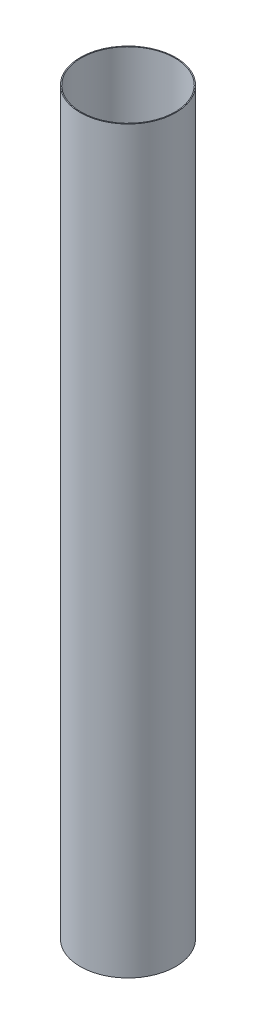
ISO-10303-21;
HEADER;
FILE_DESCRIPTION(('STEP AP214'),'2;1');
FILE_NAME('part.step','',(''),(''),'','','');
FILE_SCHEMA(('AUTOMOTIVE_DESIGN { 1 0 10303 214 1 1 1 1 }'));
ENDSEC;
DATA;
#1=APPLICATION_CONTEXT('core data for automotive mechanical design processes');
#2=APPLICATION_PROTOCOL_DEFINITION('international standard','automotive_design',2000,#1);
#3=PRODUCT_CONTEXT('',#1,'mechanical');
#4=PRODUCT('Part','Part','',(#3));
#5=PRODUCT_RELATED_PRODUCT_CATEGORY('part','',(#4));
#6=PRODUCT_DEFINITION_FORMATION('','',#4);
#7=PRODUCT_DEFINITION_CONTEXT('part definition',#1,'design');
#8=PRODUCT_DEFINITION('design','',#6,#7);
#9=PRODUCT_DEFINITION_SHAPE('','',#8);
#10=(LENGTH_UNIT() NAMED_UNIT(*) SI_UNIT(.MILLI.,.METRE.));
#11=(NAMED_UNIT(*) PLANE_ANGLE_UNIT() SI_UNIT($,.RADIAN.));
#12=(NAMED_UNIT(*) SI_UNIT($,.STERADIAN.) SOLID_ANGLE_UNIT());
#13=UNCERTAINTY_MEASURE_WITH_UNIT(LENGTH_MEASURE(1.E-05),#10,'distance_accuracy_value','');
#14=(GEOMETRIC_REPRESENTATION_CONTEXT(3) GLOBAL_UNCERTAINTY_ASSIGNED_CONTEXT((#13)) GLOBAL_UNIT_ASSIGNED_CONTEXT((#10,
#11,#12)) REPRESENTATION_CONTEXT('',''));
#15=CARTESIAN_POINT('',(0.,0.,0.));
#16=DIRECTION('',(0.,0.,1.));
#17=DIRECTION('',(1.,0.,0.));
#18=AXIS2_PLACEMENT_3D('',#15,#16,#17);
#19=CARTESIAN_POINT('',(0.,1041.4,0.));
#20=DIRECTION('',(0.,1.,0.));
#21=DIRECTION('',(0.,0.,1.));
#22=AXIS2_PLACEMENT_3D('',#19,#20,#21);
#23=PLANE('',#22);
#24=CARTESIAN_POINT('',(0.,1041.4,0.));
#25=DIRECTION('',(0.,1.,0.));
#26=DIRECTION('',(0.,0.,1.));
#27=AXIS2_PLACEMENT_3D('',#24,#25,#26);
#28=CIRCLE('',#27,67.31);
#29=CARTESIAN_POINT('',(0.,1041.4,67.31));
#30=VERTEX_POINT('',#29);
#31=EDGE_CURVE('E10',#30,#30,#28,.T.);
#32=ORIENTED_EDGE('',*,*,#31,.T.);
#33=EDGE_LOOP('',(#32));
#34=FACE_BOUND('',#33,.T.);
#35=CARTESIAN_POINT('',(0.,1041.4,0.));
#36=DIRECTION('',(0.,1.,0.));
#37=DIRECTION('',(0.,0.,1.));
#38=AXIS2_PLACEMENT_3D('',#35,#36,#37);
#39=CIRCLE('',#38,66.04);
#40=CARTESIAN_POINT('',(0.,1041.4,66.04));
#41=VERTEX_POINT('',#40);
#42=EDGE_CURVE('E41',#41,#41,#39,.T.);
#43=ORIENTED_EDGE('',*,*,#42,.F.);
#44=EDGE_LOOP('',(#43));
#45=FACE_BOUND('',#44,.T.);
#46=ADVANCED_FACE('F30',(#34,#45),#23,.T.);
#47=CARTESIAN_POINT('',(0.,0.,0.));
#48=DIRECTION('',(0.,1.,0.));
#49=DIRECTION('',(0.,0.,1.));
#50=AXIS2_PLACEMENT_3D('',#47,#48,#49);
#51=PLANE('',#50);
#52=CARTESIAN_POINT('',(0.,0.,0.));
#53=DIRECTION('',(0.,1.,0.));
#54=DIRECTION('',(0.,0.,1.));
#55=AXIS2_PLACEMENT_3D('',#52,#53,#54);
#56=CIRCLE('',#55,67.31);
#57=CARTESIAN_POINT('',(0.,0.,67.31));
#58=VERTEX_POINT('',#57);
#59=EDGE_CURVE('E34',#58,#58,#56,.T.);
#60=ORIENTED_EDGE('',*,*,#59,.F.);
#61=EDGE_LOOP('',(#60));
#62=FACE_BOUND('',#61,.T.);
#63=CARTESIAN_POINT('',(0.,0.,0.));
#64=DIRECTION('',(0.,1.,0.));
#65=DIRECTION('',(0.,0.,1.));
#66=AXIS2_PLACEMENT_3D('',#63,#64,#65);
#67=CIRCLE('',#66,66.04);
#68=CARTESIAN_POINT('',(0.,0.,66.04));
#69=VERTEX_POINT('',#68);
#70=EDGE_CURVE('E43',#69,#69,#67,.T.);
#71=ORIENTED_EDGE('',*,*,#70,.T.);
#72=EDGE_LOOP('',(#71));
#73=FACE_BOUND('',#72,.T.);
#74=ADVANCED_FACE('F53',(#62,#73),#51,.F.);
#75=CARTESIAN_POINT('',(0.,1041.4,0.));
#76=DIRECTION('',(0.,-1.,0.));
#77=DIRECTION('',(0.,0.,-1.));
#78=AXIS2_PLACEMENT_3D('',#75,#76,#77);
#79=CYLINDRICAL_SURFACE('',#78,67.31);
#80=ORIENTED_EDGE('',*,*,#31,.F.);
#81=EDGE_LOOP('',(#80));
#82=FACE_BOUND('',#81,.T.);
#83=ORIENTED_EDGE('',*,*,#59,.T.);
#84=EDGE_LOOP('',(#83));
#85=FACE_BOUND('',#84,.T.);
#86=ADVANCED_FACE('F32',(#82,#85),#79,.T.);
#87=CARTESIAN_POINT('',(0.,1041.4,0.));
#88=DIRECTION('',(0.,-1.,0.));
#89=DIRECTION('',(0.,0.,-1.));
#90=AXIS2_PLACEMENT_3D('',#87,#88,#89);
#91=CYLINDRICAL_SURFACE('',#90,66.04);
#92=ORIENTED_EDGE('',*,*,#42,.T.);
#93=EDGE_LOOP('',(#92));
#94=FACE_BOUND('',#93,.T.);
#95=ORIENTED_EDGE('',*,*,#70,.F.);
#96=EDGE_LOOP('',(#95));
#97=FACE_BOUND('',#96,.T.);
#98=ADVANCED_FACE('F49',(#94,#97),#91,.F.);
#99=CLOSED_SHELL('',(#46,#74,#86,#98));
#100=MANIFOLD_SOLID_BREP('B2',#99);
#101=ADVANCED_BREP_SHAPE_REPRESENTATION('',(#18,#100),#14);
#102=SHAPE_DEFINITION_REPRESENTATION(#9,#101);
ENDSEC;
END-ISO-10303-21;
